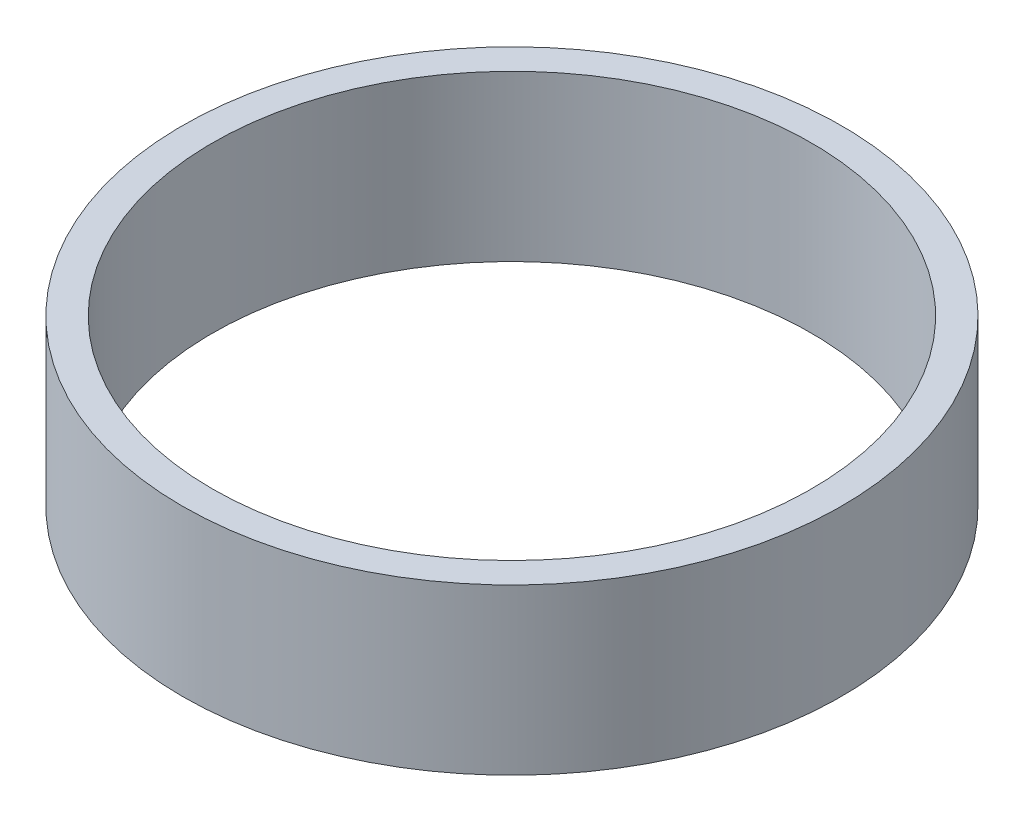
ISO-10303-21;
HEADER;
FILE_DESCRIPTION(('STEP AP214'),'2;1');
FILE_NAME('part.step','',(''),(''),'','','');
FILE_SCHEMA(('AUTOMOTIVE_DESIGN { 1 0 10303 214 1 1 1 1 }'));
ENDSEC;
DATA;
#1=APPLICATION_CONTEXT('core data for automotive mechanical design processes');
#2=APPLICATION_PROTOCOL_DEFINITION('international standard','automotive_design',2000,#1);
#3=PRODUCT_CONTEXT('',#1,'mechanical');
#4=PRODUCT('Part','Part','',(#3));
#5=PRODUCT_RELATED_PRODUCT_CATEGORY('part','',(#4));
#6=PRODUCT_DEFINITION_FORMATION('','',#4);
#7=PRODUCT_DEFINITION_CONTEXT('part definition',#1,'design');
#8=PRODUCT_DEFINITION('design','',#6,#7);
#9=PRODUCT_DEFINITION_SHAPE('','',#8);
#10=(LENGTH_UNIT() NAMED_UNIT(*) SI_UNIT(.MILLI.,.METRE.));
#11=(NAMED_UNIT(*) PLANE_ANGLE_UNIT() SI_UNIT($,.RADIAN.));
#12=(NAMED_UNIT(*) SI_UNIT($,.STERADIAN.) SOLID_ANGLE_UNIT());
#13=UNCERTAINTY_MEASURE_WITH_UNIT(LENGTH_MEASURE(1.E-05),#10,'distance_accuracy_value','');
#14=(GEOMETRIC_REPRESENTATION_CONTEXT(3) GLOBAL_UNCERTAINTY_ASSIGNED_CONTEXT((#13)) GLOBAL_UNIT_ASSIGNED_CONTEXT((#10,
#11,#12)) REPRESENTATION_CONTEXT('',''));
#15=CARTESIAN_POINT('',(0.,0.,0.));
#16=DIRECTION('',(0.,0.,1.));
#17=DIRECTION('',(1.,0.,0.));
#18=AXIS2_PLACEMENT_3D('',#15,#16,#17);
#19=CARTESIAN_POINT('',(0.,22.,0.));
#20=DIRECTION('',(0.,1.,0.));
#21=DIRECTION('',(0.,0.,1.));
#22=AXIS2_PLACEMENT_3D('',#19,#20,#21);
#23=PLANE('',#22);
#24=CARTESIAN_POINT('',(0.,22.,0.));
#25=DIRECTION('',(0.,1.,0.));
#26=DIRECTION('',(0.,0.,1.));
#27=AXIS2_PLACEMENT_3D('',#24,#25,#26);
#28=CIRCLE('',#27,44.);
#29=CARTESIAN_POINT('',(0.,22.,44.));
#30=VERTEX_POINT('',#29);
#31=EDGE_CURVE('E10',#30,#30,#28,.T.);
#32=ORIENTED_EDGE('',*,*,#31,.T.);
#33=EDGE_LOOP('',(#32));
#34=FACE_BOUND('',#33,.T.);
#35=CARTESIAN_POINT('',(0.,22.,0.));
#36=DIRECTION('',(0.,1.,0.));
#37=DIRECTION('',(0.,0.,1.));
#38=AXIS2_PLACEMENT_3D('',#35,#36,#37);
#39=CIRCLE('',#38,40.);
#40=CARTESIAN_POINT('',(0.,22.,40.));
#41=VERTEX_POINT('',#40);
#42=EDGE_CURVE('E42',#41,#41,#39,.T.);
#43=ORIENTED_EDGE('',*,*,#42,.F.);
#44=EDGE_LOOP('',(#43));
#45=FACE_BOUND('',#44,.T.);
#46=ADVANCED_FACE('F31',(#34,#45),#23,.T.);
#47=CARTESIAN_POINT('',(0.,0.,0.));
#48=DIRECTION('',(0.,1.,0.));
#49=DIRECTION('',(0.,0.,1.));
#50=AXIS2_PLACEMENT_3D('',#47,#48,#49);
#51=PLANE('',#50);
#52=CARTESIAN_POINT('',(0.,0.,0.));
#53=DIRECTION('',(0.,1.,0.));
#54=DIRECTION('',(0.,0.,1.));
#55=AXIS2_PLACEMENT_3D('',#52,#53,#54);
#56=CIRCLE('',#55,44.);
#57=CARTESIAN_POINT('',(0.,0.,44.));
#58=VERTEX_POINT('',#57);
#59=EDGE_CURVE('E35',#58,#58,#56,.T.);
#60=ORIENTED_EDGE('',*,*,#59,.F.);
#61=EDGE_LOOP('',(#60));
#62=FACE_BOUND('',#61,.T.);
#63=CARTESIAN_POINT('',(0.,0.,0.));
#64=DIRECTION('',(0.,1.,0.));
#65=DIRECTION('',(0.,0.,1.));
#66=AXIS2_PLACEMENT_3D('',#63,#64,#65);
#67=CIRCLE('',#66,40.);
#68=CARTESIAN_POINT('',(0.,0.,40.));
#69=VERTEX_POINT('',#68);
#70=EDGE_CURVE('E44',#69,#69,#67,.T.);
#71=ORIENTED_EDGE('',*,*,#70,.T.);
#72=EDGE_LOOP('',(#71));
#73=FACE_BOUND('',#72,.T.);
#74=ADVANCED_FACE('F54',(#62,#73),#51,.F.);
#75=CARTESIAN_POINT('',(0.,22.,0.));
#76=DIRECTION('',(0.,-1.,0.));
#77=DIRECTION('',(0.,0.,-1.));
#78=AXIS2_PLACEMENT_3D('',#75,#76,#77);
#79=CYLINDRICAL_SURFACE('',#78,44.);
#80=ORIENTED_EDGE('',*,*,#31,.F.);
#81=EDGE_LOOP('',(#80));
#82=FACE_BOUND('',#81,.T.);
#83=ORIENTED_EDGE('',*,*,#59,.T.);
#84=EDGE_LOOP('',(#83));
#85=FACE_BOUND('',#84,.T.);
#86=ADVANCED_FACE('F33',(#82,#85),#79,.T.);
#87=CARTESIAN_POINT('',(0.,22.,0.));
#88=DIRECTION('',(0.,-1.,0.));
#89=DIRECTION('',(0.,0.,-1.));
#90=AXIS2_PLACEMENT_3D('',#87,#88,#89);
#91=CYLINDRICAL_SURFACE('',#90,40.);
#92=ORIENTED_EDGE('',*,*,#42,.T.);
#93=EDGE_LOOP('',(#92));
#94=FACE_BOUND('',#93,.T.);
#95=ORIENTED_EDGE('',*,*,#70,.F.);
#96=EDGE_LOOP('',(#95));
#97=FACE_BOUND('',#96,.T.);
#98=ADVANCED_FACE('F50',(#94,#97),#91,.F.);
#99=CLOSED_SHELL('',(#46,#74,#86,#98));
#100=MANIFOLD_SOLID_BREP('B2',#99);
#101=ADVANCED_BREP_SHAPE_REPRESENTATION('',(#18,#100),#14);
#102=SHAPE_DEFINITION_REPRESENTATION(#9,#101);
ENDSEC;
END-ISO-10303-21;
